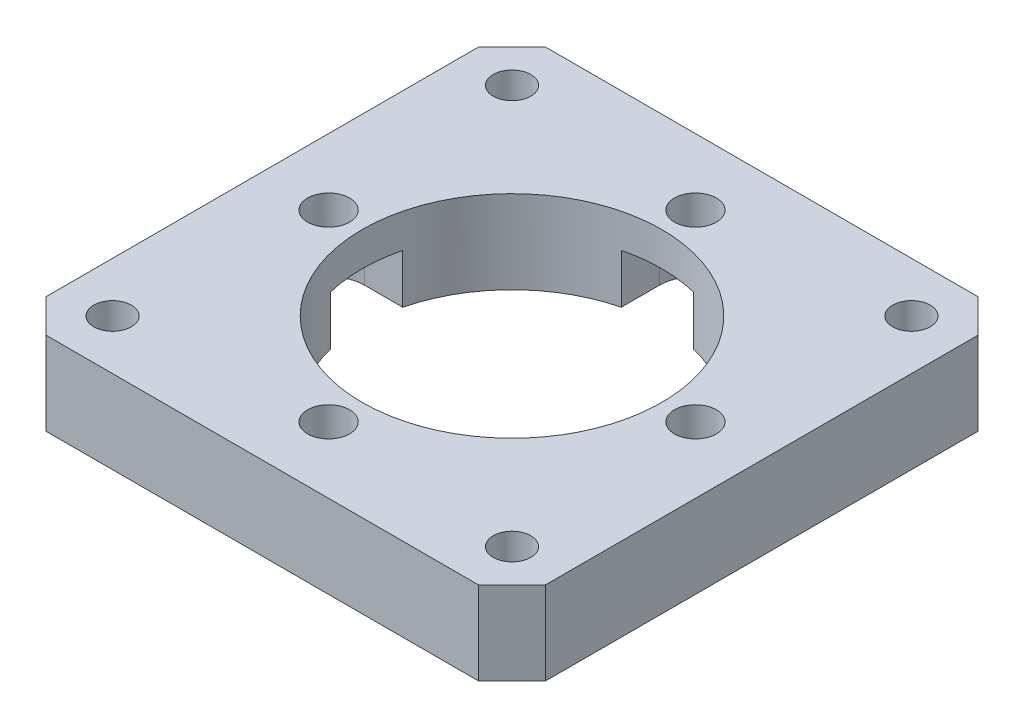
ISO-10303-21;
HEADER;
FILE_DESCRIPTION(('STEP AP214'),'2;1');
FILE_NAME('part.step','',(''),(''),'','','');
FILE_SCHEMA(('AUTOMOTIVE_DESIGN { 1 0 10303 214 1 1 1 1 }'));
ENDSEC;
DATA;
#1=APPLICATION_CONTEXT('core data for automotive mechanical design processes');
#2=APPLICATION_PROTOCOL_DEFINITION('international standard','automotive_design',2000,#1);
#3=PRODUCT_CONTEXT('',#1,'mechanical');
#4=PRODUCT('Part','Part','',(#3));
#5=PRODUCT_RELATED_PRODUCT_CATEGORY('part','',(#4));
#6=PRODUCT_DEFINITION_FORMATION('','',#4);
#7=PRODUCT_DEFINITION_CONTEXT('part definition',#1,'design');
#8=PRODUCT_DEFINITION('design','',#6,#7);
#9=PRODUCT_DEFINITION_SHAPE('','',#8);
#10=(LENGTH_UNIT() NAMED_UNIT(*) SI_UNIT(.MILLI.,.METRE.));
#11=(NAMED_UNIT(*) PLANE_ANGLE_UNIT() SI_UNIT($,.RADIAN.));
#12=(NAMED_UNIT(*) SI_UNIT($,.STERADIAN.) SOLID_ANGLE_UNIT());
#13=UNCERTAINTY_MEASURE_WITH_UNIT(LENGTH_MEASURE(1.E-05),#10,'distance_accuracy_value','');
#14=(GEOMETRIC_REPRESENTATION_CONTEXT(3) GLOBAL_UNCERTAINTY_ASSIGNED_CONTEXT((#13)) GLOBAL_UNIT_ASSIGNED_CONTEXT((#10,
#11,#12)) REPRESENTATION_CONTEXT('',''));
#15=CARTESIAN_POINT('',(0.,0.,0.));
#16=DIRECTION('',(0.,0.,1.));
#17=DIRECTION('',(1.,0.,0.));
#18=AXIS2_PLACEMENT_3D('',#15,#16,#17);
#19=CARTESIAN_POINT('',(0.,0.,-13.9954));
#20=DIRECTION('',(0.,1.,0.));
#21=DIRECTION('',(0.,0.,1.));
#22=AXIS2_PLACEMENT_3D('',#19,#20,#21);
#23=CYLINDRICAL_SURFACE('',#22,1.6002);
#24=CARTESIAN_POINT('',(0.,6.35,-13.9954));
#25=DIRECTION('',(0.,1.,0.));
#26=DIRECTION('',(0.,0.,1.));
#27=AXIS2_PLACEMENT_3D('',#24,#25,#26);
#28=CIRCLE('',#27,1.6002);
#29=CARTESIAN_POINT('',(0.,6.35,-12.3952));
#30=VERTEX_POINT('',#29);
#31=EDGE_CURVE('E327',#30,#30,#28,.T.);
#32=ORIENTED_EDGE('',*,*,#31,.T.);
#33=EDGE_LOOP('',(#32));
#34=FACE_BOUND('',#33,.T.);
#35=CARTESIAN_POINT('',(0.,3.7592,-13.9954));
#36=DIRECTION('',(0.,-1.,0.));
#37=DIRECTION('',(0.,0.,-1.));
#38=AXIS2_PLACEMENT_3D('',#35,#36,#37);
#39=CIRCLE('',#38,1.6002);
#40=CARTESIAN_POINT('',(0.,3.7592,-15.5956));
#41=VERTEX_POINT('',#40);
#42=EDGE_CURVE('E267',#41,#41,#39,.F.);
#43=ORIENTED_EDGE('',*,*,#42,.F.);
#44=EDGE_LOOP('',(#43));
#45=FACE_BOUND('',#44,.T.);
#46=ADVANCED_FACE('F37',(#34,#45),#23,.F.);
#47=CARTESIAN_POINT('',(13.9954,0.,0.));
#48=DIRECTION('',(0.,1.,0.));
#49=DIRECTION('',(0.,0.,1.));
#50=AXIS2_PLACEMENT_3D('',#47,#48,#49);
#51=CYLINDRICAL_SURFACE('',#50,1.6002);
#52=CARTESIAN_POINT('',(13.9954,6.35,0.));
#53=DIRECTION('',(0.,1.,0.));
#54=DIRECTION('',(-1.,0.,0.));
#55=AXIS2_PLACEMENT_3D('',#52,#53,#54);
#56=CIRCLE('',#55,1.6002);
#57=CARTESIAN_POINT('',(12.3952,6.35,0.));
#58=VERTEX_POINT('',#57);
#59=EDGE_CURVE('E303',#58,#58,#56,.T.);
#60=ORIENTED_EDGE('',*,*,#59,.T.);
#61=EDGE_LOOP('',(#60));
#62=FACE_BOUND('',#61,.T.);
#63=CARTESIAN_POINT('',(13.9954,3.7592,0.));
#64=DIRECTION('',(0.,-1.,0.));
#65=DIRECTION('',(0.,0.,-1.));
#66=AXIS2_PLACEMENT_3D('',#63,#64,#65);
#67=CIRCLE('',#66,1.6002);
#68=CARTESIAN_POINT('',(13.9954,3.7592,-1.60019999999995));
#69=VERTEX_POINT('',#68);
#70=EDGE_CURVE('E264',#69,#69,#67,.F.);
#71=ORIENTED_EDGE('',*,*,#70,.F.);
#72=EDGE_LOOP('',(#71));
#73=FACE_BOUND('',#72,.T.);
#74=ADVANCED_FACE('F489',(#62,#73),#51,.F.);
#75=CARTESIAN_POINT('',(-13.9954,0.,-1.46594033788936E-13));
#76=DIRECTION('',(0.,1.,0.));
#77=DIRECTION('',(0.,0.,1.));
#78=AXIS2_PLACEMENT_3D('',#75,#76,#77);
#79=CYLINDRICAL_SURFACE('',#78,1.6002);
#80=CARTESIAN_POINT('',(-13.9954,6.35,-1.46594033788936E-13));
#81=DIRECTION('',(0.,1.,0.));
#82=DIRECTION('',(1.,0.,0.));
#83=AXIS2_PLACEMENT_3D('',#80,#81,#82);
#84=CIRCLE('',#83,1.6002);
#85=CARTESIAN_POINT('',(-12.3952,6.35,-1.29832828473685E-13));
#86=VERTEX_POINT('',#85);
#87=EDGE_CURVE('E316',#86,#86,#84,.T.);
#88=ORIENTED_EDGE('',*,*,#87,.T.);
#89=EDGE_LOOP('',(#88));
#90=FACE_BOUND('',#89,.T.);
#91=CARTESIAN_POINT('',(-13.9954,3.7592,-1.46594033788936E-13));
#92=DIRECTION('',(0.,-1.,0.));
#93=DIRECTION('',(0.,0.,-1.));
#94=AXIS2_PLACEMENT_3D('',#91,#92,#93);
#95=CIRCLE('',#94,1.6002);
#96=CARTESIAN_POINT('',(-13.9954,3.7592,-1.60020000000015));
#97=VERTEX_POINT('',#96);
#98=EDGE_CURVE('E262',#97,#97,#95,.F.);
#99=ORIENTED_EDGE('',*,*,#98,.F.);
#100=EDGE_LOOP('',(#99));
#101=FACE_BOUND('',#100,.T.);
#102=ADVANCED_FACE('F495',(#90,#101),#79,.F.);
#103=CARTESIAN_POINT('',(0.,0.,13.9954));
#104=DIRECTION('',(0.,1.,0.));
#105=DIRECTION('',(0.,0.,1.));
#106=AXIS2_PLACEMENT_3D('',#103,#104,#105);
#107=CYLINDRICAL_SURFACE('',#106,1.6002);
#108=CARTESIAN_POINT('',(0.,6.35,13.9954));
#109=DIRECTION('',(0.,1.,0.));
#110=DIRECTION('',(0.,0.,-1.));
#111=AXIS2_PLACEMENT_3D('',#108,#109,#110);
#112=CIRCLE('',#111,1.6002);
#113=CARTESIAN_POINT('',(0.,6.35,12.3952));
#114=VERTEX_POINT('',#113);
#115=EDGE_CURVE('E307',#114,#114,#112,.T.);
#116=ORIENTED_EDGE('',*,*,#115,.T.);
#117=EDGE_LOOP('',(#116));
#118=FACE_BOUND('',#117,.T.);
#119=CARTESIAN_POINT('',(0.,3.7592,13.9954));
#120=DIRECTION('',(0.,-1.,0.));
#121=DIRECTION('',(0.,0.,-1.));
#122=AXIS2_PLACEMENT_3D('',#119,#120,#121);
#123=CIRCLE('',#122,1.6002);
#124=CARTESIAN_POINT('',(0.,3.7592,12.3952));
#125=VERTEX_POINT('',#124);
#126=EDGE_CURVE('E294',#125,#125,#123,.F.);
#127=ORIENTED_EDGE('',*,*,#126,.F.);
#128=EDGE_LOOP('',(#127));
#129=FACE_BOUND('',#128,.T.);
#130=ADVANCED_FACE('F512',(#118,#129),#107,.F.);
#131=CARTESIAN_POINT('',(0.,6.35,0.));
#132=DIRECTION('',(0.,1.,0.));
#133=DIRECTION('',(0.,0.,1.));
#134=AXIS2_PLACEMENT_3D('',#131,#132,#133);
#135=PLANE('',#134);
#136=CARTESIAN_POINT('',(-15.2399999999998,6.35,-15.2400000000002));
#137=DIRECTION('',(0.,1.,0.));
#138=DIRECTION('',(1.,0.,0.));
#139=AXIS2_PLACEMENT_3D('',#136,#137,#138);
#140=CIRCLE('',#139,1.4351);
#141=CARTESIAN_POINT('',(-13.8048999999998,6.35,-15.2400000000001));
#142=VERTEX_POINT('',#141);
#143=EDGE_CURVE('E299',#142,#142,#140,.T.);
#144=ORIENTED_EDGE('',*,*,#143,.F.);
#145=EDGE_LOOP('',(#144));
#146=FACE_BOUND('',#145,.T.);
#147=ORIENTED_EDGE('',*,*,#87,.F.);
#148=EDGE_LOOP('',(#147));
#149=FACE_BOUND('',#148,.T.);
#150=CARTESIAN_POINT('',(-15.24,6.35,15.24));
#151=DIRECTION('',(0.,1.,0.));
#152=DIRECTION('',(0.,0.,-1.));
#153=AXIS2_PLACEMENT_3D('',#150,#151,#152);
#154=CIRCLE('',#153,1.4351);
#155=CARTESIAN_POINT('',(-15.24,6.35,13.8049));
#156=VERTEX_POINT('',#155);
#157=EDGE_CURVE('E313',#156,#156,#154,.T.);
#158=ORIENTED_EDGE('',*,*,#157,.F.);
#159=EDGE_LOOP('',(#158));
#160=FACE_BOUND('',#159,.T.);
#161=ORIENTED_EDGE('',*,*,#115,.F.);
#162=EDGE_LOOP('',(#161));
#163=FACE_BOUND('',#162,.T.);
#164=CARTESIAN_POINT('',(15.2399999999999,6.35,15.2400000000001));
#165=DIRECTION('',(0.,1.,0.));
#166=DIRECTION('',(-1.,0.,0.));
#167=AXIS2_PLACEMENT_3D('',#164,#165,#166);
#168=CIRCLE('',#167,1.4351);
#169=CARTESIAN_POINT('',(13.8048999999999,6.35,15.24));
#170=VERTEX_POINT('',#169);
#171=EDGE_CURVE('E304',#170,#170,#168,.T.);
#172=ORIENTED_EDGE('',*,*,#171,.F.);
#173=EDGE_LOOP('',(#172));
#174=FACE_BOUND('',#173,.T.);
#175=ORIENTED_EDGE('',*,*,#59,.F.);
#176=EDGE_LOOP('',(#175));
#177=FACE_BOUND('',#176,.T.);
#178=ORIENTED_EDGE('',*,*,#31,.F.);
#179=EDGE_LOOP('',(#178));
#180=FACE_BOUND('',#179,.T.);
#181=CARTESIAN_POINT('',(15.24,6.35,-15.24));
#182=DIRECTION('',(0.,1.,0.));
#183=DIRECTION('',(0.,0.,1.));
#184=AXIS2_PLACEMENT_3D('',#181,#182,#183);
#185=CIRCLE('',#184,1.4351);
#186=CARTESIAN_POINT('',(15.24,6.35,-13.8049));
#187=VERTEX_POINT('',#186);
#188=EDGE_CURVE('E326',#187,#187,#185,.T.);
#189=ORIENTED_EDGE('',*,*,#188,.F.);
#190=EDGE_LOOP('',(#189));
#191=FACE_BOUND('',#190,.T.);
#192=DIRECTION('',(0.,0.,1.));
#193=VECTOR('',#192,1.);
#194=CARTESIAN_POINT('',(-19.05,6.35,-19.05));
#195=LINE('',#194,#193);
#196=CARTESIAN_POINT('',(-19.05,6.35,-16.51));
#197=VERTEX_POINT('',#196);
#198=CARTESIAN_POINT('',(-19.05,6.35,16.51));
#199=VERTEX_POINT('',#198);
#200=EDGE_CURVE('E351',#197,#199,#195,.T.);
#201=ORIENTED_EDGE('',*,*,#200,.T.);
#202=DIRECTION('',(-0.707106781186547,0.,-0.707106781186548));
#203=VECTOR('',#202,1.);
#204=CARTESIAN_POINT('',(-17.78,6.35,17.78));
#205=LINE('',#204,#203);
#206=CARTESIAN_POINT('',(-16.51,6.35,19.05));
#207=VERTEX_POINT('',#206);
#208=EDGE_CURVE('E391',#199,#207,#205,.F.);
#209=ORIENTED_EDGE('',*,*,#208,.T.);
#210=DIRECTION('',(1.,0.,0.));
#211=VECTOR('',#210,1.);
#212=CARTESIAN_POINT('',(-19.05,6.35,19.05));
#213=LINE('',#212,#211);
#214=CARTESIAN_POINT('',(16.51,6.35,19.05));
#215=VERTEX_POINT('',#214);
#216=EDGE_CURVE('E354',#207,#215,#213,.T.);
#217=ORIENTED_EDGE('',*,*,#216,.T.);
#218=DIRECTION('',(-0.707106781186549,0.,0.707106781186546));
#219=VECTOR('',#218,1.);
#220=CARTESIAN_POINT('',(17.7799999999999,6.35,17.78));
#221=LINE('',#220,#219);
#222=CARTESIAN_POINT('',(19.05,6.35,16.51));
#223=VERTEX_POINT('',#222);
#224=EDGE_CURVE('E389',#215,#223,#221,.F.);
#225=ORIENTED_EDGE('',*,*,#224,.T.);
#226=DIRECTION('',(0.,0.,-1.));
#227=VECTOR('',#226,1.);
#228=CARTESIAN_POINT('',(19.05,6.35,-19.05));
#229=LINE('',#228,#227);
#230=CARTESIAN_POINT('',(19.05,6.35,-16.51));
#231=VERTEX_POINT('',#230);
#232=EDGE_CURVE('E344',#223,#231,#229,.T.);
#233=ORIENTED_EDGE('',*,*,#232,.T.);
#234=DIRECTION('',(0.707106781186546,0.,0.707106781186549));
#235=VECTOR('',#234,1.);
#236=CARTESIAN_POINT('',(17.78,6.35,-17.78));
#237=LINE('',#236,#235);
#238=CARTESIAN_POINT('',(16.51,6.35,-19.05));
#239=VERTEX_POINT('',#238);
#240=EDGE_CURVE('E387',#231,#239,#237,.F.);
#241=ORIENTED_EDGE('',*,*,#240,.T.);
#242=DIRECTION('',(-1.,0.,0.));
#243=VECTOR('',#242,1.);
#244=CARTESIAN_POINT('',(-19.05,6.35,-19.05));
#245=LINE('',#244,#243);
#246=CARTESIAN_POINT('',(-16.51,6.35,-19.05));
#247=VERTEX_POINT('',#246);
#248=EDGE_CURVE('E347',#239,#247,#245,.T.);
#249=ORIENTED_EDGE('',*,*,#248,.T.);
#250=DIRECTION('',(0.70710678118655,0.,-0.707106781186546));
#251=VECTOR('',#250,1.);
#252=CARTESIAN_POINT('',(-17.7799999999999,6.35,-17.78));
#253=LINE('',#252,#251);
#254=EDGE_CURVE('E385',#247,#197,#253,.F.);
#255=ORIENTED_EDGE('',*,*,#254,.T.);
#256=EDGE_LOOP('',(#201,#209,#217,#225,#233,#241,#249,#255));
#257=FACE_BOUND('',#256,.T.);
#258=CARTESIAN_POINT('',(0.,6.35,0.));
#259=DIRECTION('',(0.,1.,0.));
#260=DIRECTION('',(0.,0.,1.));
#261=AXIS2_PLACEMENT_3D('',#258,#259,#260);
#262=CIRCLE('',#261,11.43);
#263=CARTESIAN_POINT('',(0.,6.35,11.43));
#264=VERTEX_POINT('',#263);
#265=EDGE_CURVE('E336',#264,#264,#262,.T.);
#266=ORIENTED_EDGE('',*,*,#265,.F.);
#267=EDGE_LOOP('',(#266));
#268=FACE_BOUND('',#267,.T.);
#269=ADVANCED_FACE('F509',(#146,#149,#160,#163,#174,#177,#180,#191,#257,#268),#135,.T.);
#270=CARTESIAN_POINT('',(0.,0.,0.));
#271=DIRECTION('',(0.,1.,0.));
#272=DIRECTION('',(0.,0.,1.));
#273=AXIS2_PLACEMENT_3D('',#270,#271,#272);
#274=PLANE('',#273);
#275=CARTESIAN_POINT('',(-15.2399999999998,0.,-15.2400000000002));
#276=DIRECTION('',(0.,1.,0.));
#277=DIRECTION('',(1.,0.,0.));
#278=AXIS2_PLACEMENT_3D('',#275,#276,#277);
#279=CIRCLE('',#278,1.4351);
#280=CARTESIAN_POINT('',(-13.8048999999998,0.,-15.2400000000001));
#281=VERTEX_POINT('',#280);
#282=EDGE_CURVE('E319',#281,#281,#279,.T.);
#283=ORIENTED_EDGE('',*,*,#282,.T.);
#284=EDGE_LOOP('',(#283));
#285=FACE_BOUND('',#284,.T.);
#286=CARTESIAN_POINT('',(-15.24,0.,15.24));
#287=DIRECTION('',(0.,1.,0.));
#288=DIRECTION('',(0.,0.,-1.));
#289=AXIS2_PLACEMENT_3D('',#286,#287,#288);
#290=CIRCLE('',#289,1.4351);
#291=CARTESIAN_POINT('',(-15.24,0.,13.8049));
#292=VERTEX_POINT('',#291);
#293=EDGE_CURVE('E310',#292,#292,#290,.T.);
#294=ORIENTED_EDGE('',*,*,#293,.T.);
#295=EDGE_LOOP('',(#294));
#296=FACE_BOUND('',#295,.T.);
#297=CARTESIAN_POINT('',(15.2399999999999,0.,15.2400000000001));
#298=DIRECTION('',(0.,1.,0.));
#299=DIRECTION('',(-1.,0.,0.));
#300=AXIS2_PLACEMENT_3D('',#297,#298,#299);
#301=CIRCLE('',#300,1.4351);
#302=CARTESIAN_POINT('',(13.8048999999999,0.,15.24));
#303=VERTEX_POINT('',#302);
#304=EDGE_CURVE('E300',#303,#303,#301,.T.);
#305=ORIENTED_EDGE('',*,*,#304,.T.);
#306=EDGE_LOOP('',(#305));
#307=FACE_BOUND('',#306,.T.);
#308=CARTESIAN_POINT('',(15.24,0.,-15.24));
#309=DIRECTION('',(0.,1.,0.));
#310=DIRECTION('',(0.,0.,1.));
#311=AXIS2_PLACEMENT_3D('',#308,#309,#310);
#312=CIRCLE('',#311,1.4351);
#313=CARTESIAN_POINT('',(15.24,0.,-13.8049));
#314=VERTEX_POINT('',#313);
#315=EDGE_CURVE('E331',#314,#314,#312,.T.);
#316=ORIENTED_EDGE('',*,*,#315,.T.);
#317=EDGE_LOOP('',(#316));
#318=FACE_BOUND('',#317,.T.);
#319=DIRECTION('',(1.,0.,0.));
#320=VECTOR('',#319,1.);
#321=CARTESIAN_POINT('',(-19.05,0.,19.05));
#322=LINE('',#321,#320);
#323=CARTESIAN_POINT('',(-16.51,0.,19.05));
#324=VERTEX_POINT('',#323);
#325=CARTESIAN_POINT('',(16.51,0.,19.05));
#326=VERTEX_POINT('',#325);
#327=EDGE_CURVE('E348',#324,#326,#322,.T.);
#328=ORIENTED_EDGE('',*,*,#327,.F.);
#329=DIRECTION('',(0.707106781186547,0.,0.707106781186548));
#330=VECTOR('',#329,1.);
#331=CARTESIAN_POINT('',(-16.51,0.,19.05));
#332=LINE('',#331,#330);
#333=CARTESIAN_POINT('',(-19.05,0.,16.51));
#334=VERTEX_POINT('',#333);
#335=EDGE_CURVE('E378',#324,#334,#332,.F.);
#336=ORIENTED_EDGE('',*,*,#335,.T.);
#337=DIRECTION('',(0.,0.,1.));
#338=VECTOR('',#337,1.);
#339=CARTESIAN_POINT('',(-19.05,0.,-19.05));
#340=LINE('',#339,#338);
#341=CARTESIAN_POINT('',(-19.05,0.,-16.51));
#342=VERTEX_POINT('',#341);
#343=EDGE_CURVE('E363',#342,#334,#340,.T.);
#344=ORIENTED_EDGE('',*,*,#343,.F.);
#345=DIRECTION('',(-0.70710678118655,0.,0.707106781186546));
#346=VECTOR('',#345,1.);
#347=CARTESIAN_POINT('',(-19.05,0.,-16.51));
#348=LINE('',#347,#346);
#349=CARTESIAN_POINT('',(-16.51,0.,-19.05));
#350=VERTEX_POINT('',#349);
#351=EDGE_CURVE('E372',#342,#350,#348,.F.);
#352=ORIENTED_EDGE('',*,*,#351,.T.);
#353=DIRECTION('',(-1.,0.,0.));
#354=VECTOR('',#353,1.);
#355=CARTESIAN_POINT('',(-19.05,0.,-19.05));
#356=LINE('',#355,#354);
#357=CARTESIAN_POINT('',(16.51,0.,-19.05));
#358=VERTEX_POINT('',#357);
#359=EDGE_CURVE('E360',#358,#350,#356,.T.);
#360=ORIENTED_EDGE('',*,*,#359,.F.);
#361=DIRECTION('',(-0.707106781186546,0.,-0.707106781186549));
#362=VECTOR('',#361,1.);
#363=CARTESIAN_POINT('',(16.51,0.,-19.05));
#364=LINE('',#363,#362);
#365=CARTESIAN_POINT('',(19.05,0.,-16.51));
#366=VERTEX_POINT('',#365);
#367=EDGE_CURVE('E374',#358,#366,#364,.F.);
#368=ORIENTED_EDGE('',*,*,#367,.T.);
#369=DIRECTION('',(0.,0.,-1.));
#370=VECTOR('',#369,1.);
#371=CARTESIAN_POINT('',(19.05,0.,-19.05));
#372=LINE('',#371,#370);
#373=CARTESIAN_POINT('',(19.05,0.,16.51));
#374=VERTEX_POINT('',#373);
#375=EDGE_CURVE('E339',#374,#366,#372,.T.);
#376=ORIENTED_EDGE('',*,*,#375,.F.);
#377=DIRECTION('',(0.707106781186549,0.,-0.707106781186546));
#378=VECTOR('',#377,1.);
#379=CARTESIAN_POINT('',(19.05,0.,16.51));
#380=LINE('',#379,#378);
#381=EDGE_CURVE('E376',#374,#326,#380,.F.);
#382=ORIENTED_EDGE('',*,*,#381,.T.);
#383=EDGE_LOOP('',(#328,#336,#344,#352,#360,#368,#376,#382));
#384=FACE_BOUND('',#383,.T.);
#385=CARTESIAN_POINT('',(13.9954,0.,0.));
#386=DIRECTION('',(0.,-1.,0.));
#387=DIRECTION('',(-1.,0.,0.));
#388=AXIS2_PLACEMENT_3D('',#385,#386,#387);
#389=CIRCLE('',#388,2.7559);
#390=CARTESIAN_POINT('',(13.9954,0.,-2.75590000000005));
#391=VERTEX_POINT('',#390);
#392=CARTESIAN_POINT('',(13.9954,0.,2.75589999999995));
#393=VERTEX_POINT('',#392);
#394=EDGE_CURVE('E244',#391,#393,#389,.T.);
#395=ORIENTED_EDGE('',*,*,#394,.F.);
#396=DIRECTION('',(1.,0.,0.));
#397=VECTOR('',#396,1.);
#398=CARTESIAN_POINT('',(13.9954,0.,-2.75590000000005));
#399=LINE('',#398,#397);
#400=CARTESIAN_POINT('',(11.092786628706,0.,-2.75590000000004));
#401=VERTEX_POINT('',#400);
#402=EDGE_CURVE('E248',#401,#391,#399,.T.);
#403=ORIENTED_EDGE('',*,*,#402,.F.);
#404=CARTESIAN_POINT('',(0.,0.,0.));
#405=DIRECTION('',(0.,1.,0.));
#406=DIRECTION('',(0.,0.,1.));
#407=AXIS2_PLACEMENT_3D('',#404,#405,#406);
#408=CIRCLE('',#407,11.43);
#409=CARTESIAN_POINT('',(2.7559,0.,-11.0927866287061));
#410=VERTEX_POINT('',#409);
#411=EDGE_CURVE('E343',#401,#410,#408,.T.);
#412=ORIENTED_EDGE('',*,*,#411,.T.);
#413=DIRECTION('',(0.,0.,1.));
#414=VECTOR('',#413,1.);
#415=CARTESIAN_POINT('',(2.7559,0.,-13.9954));
#416=LINE('',#415,#414);
#417=CARTESIAN_POINT('',(2.7559,0.,-13.9954));
#418=VERTEX_POINT('',#417);
#419=EDGE_CURVE('E238',#418,#410,#416,.T.);
#420=ORIENTED_EDGE('',*,*,#419,.F.);
#421=CARTESIAN_POINT('',(0.,0.,-13.9954));
#422=DIRECTION('',(0.,-1.,0.));
#423=DIRECTION('',(0.,0.,1.));
#424=AXIS2_PLACEMENT_3D('',#421,#422,#423);
#425=CIRCLE('',#424,2.7559);
#426=CARTESIAN_POINT('',(-2.7559,0.,-13.9954));
#427=VERTEX_POINT('',#426);
#428=EDGE_CURVE('E224',#427,#418,#425,.T.);
#429=ORIENTED_EDGE('',*,*,#428,.F.);
#430=DIRECTION('',(0.,0.,-1.));
#431=VECTOR('',#430,1.);
#432=CARTESIAN_POINT('',(-2.7559,0.,-13.9954));
#433=LINE('',#432,#431);
#434=CARTESIAN_POINT('',(-2.7559,0.,-11.0927866287061));
#435=VERTEX_POINT('',#434);
#436=EDGE_CURVE('E230',#435,#427,#433,.T.);
#437=ORIENTED_EDGE('',*,*,#436,.F.);
#438=CARTESIAN_POINT('',(-11.0927866287061,0.,-2.75589999999988));
#439=VERTEX_POINT('',#438);
#440=EDGE_CURVE('E441',#435,#439,#408,.T.);
#441=ORIENTED_EDGE('',*,*,#440,.T.);
#442=DIRECTION('',(1.,0.,0.));
#443=VECTOR('',#442,1.);
#444=CARTESIAN_POINT('',(-13.9954,0.,-2.75589999999985));
#445=LINE('',#444,#443);
#446=CARTESIAN_POINT('',(-13.9954,0.,-2.75589999999985));
#447=VERTEX_POINT('',#446);
#448=EDGE_CURVE('E61',#447,#439,#445,.T.);
#449=ORIENTED_EDGE('',*,*,#448,.F.);
#450=CARTESIAN_POINT('',(-13.9954,0.,1.46594033788936E-13));
#451=DIRECTION('',(0.,-1.,0.));
#452=DIRECTION('',(1.,0.,0.));
#453=AXIS2_PLACEMENT_3D('',#450,#451,#452);
#454=CIRCLE('',#453,2.7559);
#455=CARTESIAN_POINT('',(-13.9954,0.,2.75590000000015));
#456=VERTEX_POINT('',#455);
#457=EDGE_CURVE('E206',#456,#447,#454,.T.);
#458=ORIENTED_EDGE('',*,*,#457,.F.);
#459=DIRECTION('',(-1.,0.,0.));
#460=VECTOR('',#459,1.);
#461=CARTESIAN_POINT('',(13.9954,0.,2.75589999999995));
#462=LINE('',#461,#460);
#463=CARTESIAN_POINT('',(-11.0927866287061,0.,2.75590000000004));
#464=VERTEX_POINT('',#463);
#465=EDGE_CURVE('E255',#464,#456,#462,.T.);
#466=ORIENTED_EDGE('',*,*,#465,.F.);
#467=CARTESIAN_POINT('',(-2.7559,0.,11.0927866287061));
#468=VERTEX_POINT('',#467);
#469=EDGE_CURVE('E330',#464,#468,#408,.T.);
#470=ORIENTED_EDGE('',*,*,#469,.T.);
#471=DIRECTION('',(0.,0.,-1.));
#472=VECTOR('',#471,1.);
#473=CARTESIAN_POINT('',(-2.7559,0.,13.9954));
#474=LINE('',#473,#472);
#475=CARTESIAN_POINT('',(-2.7559,0.,13.9954));
#476=VERTEX_POINT('',#475);
#477=EDGE_CURVE('E287',#476,#468,#474,.T.);
#478=ORIENTED_EDGE('',*,*,#477,.F.);
#479=CARTESIAN_POINT('',(0.,0.,13.9954));
#480=DIRECTION('',(0.,-1.,0.));
#481=DIRECTION('',(0.,0.,-1.));
#482=AXIS2_PLACEMENT_3D('',#479,#480,#481);
#483=CIRCLE('',#482,2.7559);
#484=CARTESIAN_POINT('',(2.7559,0.,13.9954));
#485=VERTEX_POINT('',#484);
#486=EDGE_CURVE('E284',#485,#476,#483,.T.);
#487=ORIENTED_EDGE('',*,*,#486,.F.);
#488=DIRECTION('',(0.,0.,1.));
#489=VECTOR('',#488,1.);
#490=CARTESIAN_POINT('',(2.7559,0.,13.9954));
#491=LINE('',#490,#489);
#492=CARTESIAN_POINT('',(2.7559,0.,11.0927866287061));
#493=VERTEX_POINT('',#492);
#494=EDGE_CURVE('E279',#493,#485,#491,.T.);
#495=ORIENTED_EDGE('',*,*,#494,.F.);
#496=CARTESIAN_POINT('',(11.0927866287061,0.,2.75589999999996));
#497=VERTEX_POINT('',#496);
#498=EDGE_CURVE('E340',#493,#497,#408,.T.);
#499=ORIENTED_EDGE('',*,*,#498,.T.);
#500=EDGE_CURVE('E256',#393,#497,#462,.T.);
#501=ORIENTED_EDGE('',*,*,#500,.F.);
#502=EDGE_LOOP('',(#395,#403,#412,#420,#429,#437,#441,#449,#458,#466,#470,#478,#487,#495,#499,#501));
#503=FACE_BOUND('',#502,.T.);
#504=ADVANCED_FACE('F439',(#285,#296,#307,#318,#384,#503),#274,.F.);
#505=CARTESIAN_POINT('',(19.05,6.35,-19.05));
#506=DIRECTION('',(-1.,0.,0.));
#507=DIRECTION('',(0.,0.,1.));
#508=AXIS2_PLACEMENT_3D('',#505,#506,#507);
#509=PLANE('',#508);
#510=ORIENTED_EDGE('',*,*,#232,.F.);
#511=DIRECTION('',(0.,-1.,0.));
#512=VECTOR('',#511,1.);
#513=CARTESIAN_POINT('',(19.05,6.35,16.51));
#514=LINE('',#513,#512);
#515=EDGE_CURVE('E395',#223,#374,#514,.T.);
#516=ORIENTED_EDGE('',*,*,#515,.T.);
#517=ORIENTED_EDGE('',*,*,#375,.T.);
#518=DIRECTION('',(0.,1.,0.));
#519=VECTOR('',#518,1.);
#520=CARTESIAN_POINT('',(19.05,6.35,-16.51));
#521=LINE('',#520,#519);
#522=EDGE_CURVE('E393',#366,#231,#521,.T.);
#523=ORIENTED_EDGE('',*,*,#522,.T.);
#524=EDGE_LOOP('',(#510,#516,#517,#523));
#525=FACE_BOUND('',#524,.T.);
#526=ADVANCED_FACE('F516',(#525),#509,.F.);
#527=CARTESIAN_POINT('',(-19.05,6.35,-19.05));
#528=DIRECTION('',(0.,0.,1.));
#529=DIRECTION('',(1.,0.,0.));
#530=AXIS2_PLACEMENT_3D('',#527,#528,#529);
#531=PLANE('',#530);
#532=ORIENTED_EDGE('',*,*,#248,.F.);
#533=DIRECTION('',(0.,-1.,0.));
#534=VECTOR('',#533,1.);
#535=CARTESIAN_POINT('',(16.51,6.35,-19.05));
#536=LINE('',#535,#534);
#537=EDGE_CURVE('E400',#239,#358,#536,.T.);
#538=ORIENTED_EDGE('',*,*,#537,.T.);
#539=ORIENTED_EDGE('',*,*,#359,.T.);
#540=DIRECTION('',(0.,1.,0.));
#541=VECTOR('',#540,1.);
#542=CARTESIAN_POINT('',(-16.51,6.35,-19.05));
#543=LINE('',#542,#541);
#544=EDGE_CURVE('E398',#350,#247,#543,.T.);
#545=ORIENTED_EDGE('',*,*,#544,.T.);
#546=EDGE_LOOP('',(#532,#538,#539,#545));
#547=FACE_BOUND('',#546,.T.);
#548=ADVANCED_FACE('F524',(#547),#531,.F.);
#549=CARTESIAN_POINT('',(-19.05,6.35,-19.05));
#550=DIRECTION('',(1.,0.,0.));
#551=DIRECTION('',(0.,0.,-1.));
#552=AXIS2_PLACEMENT_3D('',#549,#550,#551);
#553=PLANE('',#552);
#554=ORIENTED_EDGE('',*,*,#343,.T.);
#555=DIRECTION('',(0.,1.,0.));
#556=VECTOR('',#555,1.);
#557=CARTESIAN_POINT('',(-19.05,6.35,16.51));
#558=LINE('',#557,#556);
#559=EDGE_CURVE('E383',#334,#199,#558,.T.);
#560=ORIENTED_EDGE('',*,*,#559,.T.);
#561=ORIENTED_EDGE('',*,*,#200,.F.);
#562=DIRECTION('',(0.,-1.,0.));
#563=VECTOR('',#562,1.);
#564=CARTESIAN_POINT('',(-19.05,6.35,-16.51));
#565=LINE('',#564,#563);
#566=EDGE_CURVE('E380',#197,#342,#565,.T.);
#567=ORIENTED_EDGE('',*,*,#566,.T.);
#568=EDGE_LOOP('',(#554,#560,#561,#567));
#569=FACE_BOUND('',#568,.T.);
#570=ADVANCED_FACE('F520',(#569),#553,.F.);
#571=CARTESIAN_POINT('',(-19.05,6.35,19.05));
#572=DIRECTION('',(0.,0.,-1.));
#573=DIRECTION('',(-1.,0.,0.));
#574=AXIS2_PLACEMENT_3D('',#571,#572,#573);
#575=PLANE('',#574);
#576=ORIENTED_EDGE('',*,*,#216,.F.);
#577=DIRECTION('',(0.,-1.,0.));
#578=VECTOR('',#577,1.);
#579=CARTESIAN_POINT('',(-16.51,6.35,19.05));
#580=LINE('',#579,#578);
#581=EDGE_CURVE('E369',#207,#324,#580,.T.);
#582=ORIENTED_EDGE('',*,*,#581,.T.);
#583=ORIENTED_EDGE('',*,*,#327,.T.);
#584=DIRECTION('',(0.,1.,0.));
#585=VECTOR('',#584,1.);
#586=CARTESIAN_POINT('',(16.51,6.35,19.05));
#587=LINE('',#586,#585);
#588=EDGE_CURVE('E357',#326,#215,#587,.T.);
#589=ORIENTED_EDGE('',*,*,#588,.T.);
#590=EDGE_LOOP('',(#576,#582,#583,#589));
#591=FACE_BOUND('',#590,.T.);
#592=ADVANCED_FACE('F508',(#591),#575,.F.);
#593=CARTESIAN_POINT('',(0.,6.35,0.));
#594=DIRECTION('',(0.,-1.,0.));
#595=DIRECTION('',(0.,0.,-1.));
#596=AXIS2_PLACEMENT_3D('',#593,#594,#595);
#597=CYLINDRICAL_SURFACE('',#596,11.43);
#598=DIRECTION('',(0.,-1.,0.));
#599=VECTOR('',#598,1.);
#600=CARTESIAN_POINT('',(11.092786628706,6.35,-2.75590000000004));
#601=LINE('',#600,#599);
#602=CARTESIAN_POINT('',(11.092786628706,3.7592,-2.75590000000004));
#603=VERTEX_POINT('',#602);
#604=EDGE_CURVE('E11',#603,#401,#601,.T.);
#605=ORIENTED_EDGE('',*,*,#604,.F.);
#606=CARTESIAN_POINT('',(0.,3.7592,0.));
#607=DIRECTION('',(0.,-1.,0.));
#608=DIRECTION('',(0.,0.,-1.));
#609=AXIS2_PLACEMENT_3D('',#606,#607,#608);
#610=CIRCLE('',#609,11.43);
#611=CARTESIAN_POINT('',(11.0927866287061,3.7592,2.75589999999996));
#612=VERTEX_POINT('',#611);
#613=EDGE_CURVE('E274',#603,#612,#610,.T.);
#614=ORIENTED_EDGE('',*,*,#613,.T.);
#615=DIRECTION('',(0.,-1.,0.));
#616=VECTOR('',#615,1.);
#617=CARTESIAN_POINT('',(11.0927866287061,6.35,2.75589999999996));
#618=LINE('',#617,#616);
#619=EDGE_CURVE('E46',#497,#612,#618,.F.);
#620=ORIENTED_EDGE('',*,*,#619,.F.);
#621=ORIENTED_EDGE('',*,*,#498,.F.);
#622=DIRECTION('',(0.,-1.,0.));
#623=VECTOR('',#622,1.);
#624=CARTESIAN_POINT('',(2.7559,6.35,11.0927866287061));
#625=LINE('',#624,#623);
#626=CARTESIAN_POINT('',(2.7559,3.7592,11.0927866287061));
#627=VERTEX_POINT('',#626);
#628=EDGE_CURVE('E408',#627,#493,#625,.T.);
#629=ORIENTED_EDGE('',*,*,#628,.F.);
#630=CARTESIAN_POINT('',(0.,3.7592,0.));
#631=DIRECTION('',(0.,-1.,0.));
#632=DIRECTION('',(0.,0.,-1.));
#633=AXIS2_PLACEMENT_3D('',#630,#631,#632);
#634=CIRCLE('',#633,11.43);
#635=CARTESIAN_POINT('',(-2.7559,3.7592,11.0927866287061));
#636=VERTEX_POINT('',#635);
#637=EDGE_CURVE('E296',#627,#636,#634,.T.);
#638=ORIENTED_EDGE('',*,*,#637,.T.);
#639=DIRECTION('',(0.,-1.,0.));
#640=VECTOR('',#639,1.);
#641=CARTESIAN_POINT('',(-2.7559,6.35,11.0927866287061));
#642=LINE('',#641,#640);
#643=EDGE_CURVE('E403',#468,#636,#642,.F.);
#644=ORIENTED_EDGE('',*,*,#643,.F.);
#645=ORIENTED_EDGE('',*,*,#469,.F.);
#646=DIRECTION('',(0.,-1.,0.));
#647=VECTOR('',#646,1.);
#648=CARTESIAN_POINT('',(-11.0927866287061,6.35,2.75590000000004));
#649=LINE('',#648,#647);
#650=CARTESIAN_POINT('',(-11.0927866287061,3.7592,2.75590000000004));
#651=VERTEX_POINT('',#650);
#652=EDGE_CURVE('E413',#651,#464,#649,.T.);
#653=ORIENTED_EDGE('',*,*,#652,.F.);
#654=CARTESIAN_POINT('',(-11.0927866287061,3.7592,-2.75589999999988));
#655=VERTEX_POINT('',#654);
#656=EDGE_CURVE('E273',#651,#655,#610,.T.);
#657=ORIENTED_EDGE('',*,*,#656,.T.);
#658=DIRECTION('',(0.,-1.,0.));
#659=VECTOR('',#658,1.);
#660=CARTESIAN_POINT('',(-11.0927866287061,6.35,-2.75589999999988));
#661=LINE('',#660,#659);
#662=EDGE_CURVE('E212',#439,#655,#661,.F.);
#663=ORIENTED_EDGE('',*,*,#662,.F.);
#664=ORIENTED_EDGE('',*,*,#440,.F.);
#665=DIRECTION('',(0.,-1.,0.));
#666=VECTOR('',#665,1.);
#667=CARTESIAN_POINT('',(-2.7559,6.35,-11.0927866287061));
#668=LINE('',#667,#666);
#669=CARTESIAN_POINT('',(-2.7559,3.7592,-11.0927866287061));
#670=VERTEX_POINT('',#669);
#671=EDGE_CURVE('E417',#670,#435,#668,.T.);
#672=ORIENTED_EDGE('',*,*,#671,.F.);
#673=CARTESIAN_POINT('',(2.7559,3.7592,-11.0927866287061));
#674=VERTEX_POINT('',#673);
#675=EDGE_CURVE('E270',#670,#674,#610,.T.);
#676=ORIENTED_EDGE('',*,*,#675,.T.);
#677=DIRECTION('',(0.,-1.,0.));
#678=VECTOR('',#677,1.);
#679=CARTESIAN_POINT('',(2.7559,6.35,-11.0927866287061));
#680=LINE('',#679,#678);
#681=EDGE_CURVE('E415',#410,#674,#680,.F.);
#682=ORIENTED_EDGE('',*,*,#681,.F.);
#683=ORIENTED_EDGE('',*,*,#411,.F.);
#684=EDGE_LOOP('',(#605,#614,#620,#621,#629,#638,#644,#645,#653,#657,#663,#664,#672,#676,#682,#683));
#685=FACE_BOUND('',#684,.T.);
#686=ORIENTED_EDGE('',*,*,#265,.T.);
#687=EDGE_LOOP('',(#686));
#688=FACE_BOUND('',#687,.T.);
#689=ADVANCED_FACE('F426',(#685,#688),#597,.F.);
#690=CARTESIAN_POINT('',(15.24,0.,-15.24));
#691=DIRECTION('',(0.,1.,0.));
#692=DIRECTION('',(0.,0.,1.));
#693=AXIS2_PLACEMENT_3D('',#690,#691,#692);
#694=CYLINDRICAL_SURFACE('',#693,1.4351);
#695=ORIENTED_EDGE('',*,*,#315,.F.);
#696=EDGE_LOOP('',(#695));
#697=FACE_BOUND('',#696,.T.);
#698=ORIENTED_EDGE('',*,*,#188,.T.);
#699=EDGE_LOOP('',(#698));
#700=FACE_BOUND('',#699,.T.);
#701=ADVANCED_FACE('F501',(#697,#700),#694,.F.);
#702=CARTESIAN_POINT('',(15.2399999999999,0.,15.2400000000001));
#703=DIRECTION('',(0.,1.,0.));
#704=DIRECTION('',(0.,0.,1.));
#705=AXIS2_PLACEMENT_3D('',#702,#703,#704);
#706=CYLINDRICAL_SURFACE('',#705,1.4351);
#707=ORIENTED_EDGE('',*,*,#304,.F.);
#708=EDGE_LOOP('',(#707));
#709=FACE_BOUND('',#708,.T.);
#710=ORIENTED_EDGE('',*,*,#171,.T.);
#711=EDGE_LOOP('',(#710));
#712=FACE_BOUND('',#711,.T.);
#713=ADVANCED_FACE('F504',(#709,#712),#706,.F.);
#714=CARTESIAN_POINT('',(-15.24,0.,15.24));
#715=DIRECTION('',(0.,1.,0.));
#716=DIRECTION('',(0.,0.,1.));
#717=AXIS2_PLACEMENT_3D('',#714,#715,#716);
#718=CYLINDRICAL_SURFACE('',#717,1.4351);
#719=ORIENTED_EDGE('',*,*,#293,.F.);
#720=EDGE_LOOP('',(#719));
#721=FACE_BOUND('',#720,.T.);
#722=ORIENTED_EDGE('',*,*,#157,.T.);
#723=EDGE_LOOP('',(#722));
#724=FACE_BOUND('',#723,.T.);
#725=ADVANCED_FACE('F596',(#721,#724),#718,.F.);
#726=CARTESIAN_POINT('',(-15.2399999999998,0.,-15.2400000000002));
#727=DIRECTION('',(0.,1.,0.));
#728=DIRECTION('',(0.,0.,1.));
#729=AXIS2_PLACEMENT_3D('',#726,#727,#728);
#730=CYLINDRICAL_SURFACE('',#729,1.4351);
#731=ORIENTED_EDGE('',*,*,#282,.F.);
#732=EDGE_LOOP('',(#731));
#733=FACE_BOUND('',#732,.T.);
#734=ORIENTED_EDGE('',*,*,#143,.T.);
#735=EDGE_LOOP('',(#734));
#736=FACE_BOUND('',#735,.T.);
#737=ADVANCED_FACE('F540',(#733,#736),#730,.F.);
#738=CARTESIAN_POINT('',(-16.51,6.35,19.05));
#739=DIRECTION('',(0.707106781186548,0.,-0.707106781186547));
#740=DIRECTION('',(0.,-1.,0.));
#741=AXIS2_PLACEMENT_3D('',#738,#739,#740);
#742=PLANE('',#741);
#743=ORIENTED_EDGE('',*,*,#208,.F.);
#744=ORIENTED_EDGE('',*,*,#559,.F.);
#745=ORIENTED_EDGE('',*,*,#335,.F.);
#746=ORIENTED_EDGE('',*,*,#581,.F.);
#747=EDGE_LOOP('',(#743,#744,#745,#746));
#748=FACE_BOUND('',#747,.T.);
#749=ADVANCED_FACE('F533',(#748),#742,.F.);
#750=CARTESIAN_POINT('',(19.05,6.35,16.51));
#751=DIRECTION('',(-0.707106781186546,0.,-0.707106781186549));
#752=DIRECTION('',(0.,-1.,0.));
#753=AXIS2_PLACEMENT_3D('',#750,#751,#752);
#754=PLANE('',#753);
#755=ORIENTED_EDGE('',*,*,#224,.F.);
#756=ORIENTED_EDGE('',*,*,#588,.F.);
#757=ORIENTED_EDGE('',*,*,#381,.F.);
#758=ORIENTED_EDGE('',*,*,#515,.F.);
#759=EDGE_LOOP('',(#755,#756,#757,#758));
#760=FACE_BOUND('',#759,.T.);
#761=ADVANCED_FACE('F539',(#760),#754,.F.);
#762=CARTESIAN_POINT('',(16.51,6.35,-19.05));
#763=DIRECTION('',(-0.707106781186549,0.,0.707106781186546));
#764=DIRECTION('',(0.,-1.,0.));
#765=AXIS2_PLACEMENT_3D('',#762,#763,#764);
#766=PLANE('',#765);
#767=ORIENTED_EDGE('',*,*,#240,.F.);
#768=ORIENTED_EDGE('',*,*,#522,.F.);
#769=ORIENTED_EDGE('',*,*,#367,.F.);
#770=ORIENTED_EDGE('',*,*,#537,.F.);
#771=EDGE_LOOP('',(#767,#768,#769,#770));
#772=FACE_BOUND('',#771,.T.);
#773=ADVANCED_FACE('F546',(#772),#766,.F.);
#774=CARTESIAN_POINT('',(-19.05,6.35,-16.51));
#775=DIRECTION('',(0.707106781186546,0.,0.70710678118655));
#776=DIRECTION('',(0.,-1.,0.));
#777=AXIS2_PLACEMENT_3D('',#774,#775,#776);
#778=PLANE('',#777);
#779=ORIENTED_EDGE('',*,*,#254,.F.);
#780=ORIENTED_EDGE('',*,*,#544,.F.);
#781=ORIENTED_EDGE('',*,*,#351,.F.);
#782=ORIENTED_EDGE('',*,*,#566,.F.);
#783=EDGE_LOOP('',(#779,#780,#781,#782));
#784=FACE_BOUND('',#783,.T.);
#785=ADVANCED_FACE('F40',(#784),#778,.F.);
#786=CARTESIAN_POINT('',(0.,3.7592,13.9954));
#787=DIRECTION('',(0.,-1.,0.));
#788=DIRECTION('',(0.,0.,-1.));
#789=AXIS2_PLACEMENT_3D('',#786,#787,#788);
#790=PLANE('',#789);
#791=DIRECTION('',(0.,0.,1.));
#792=VECTOR('',#791,1.);
#793=CARTESIAN_POINT('',(2.7559,3.7592,13.9954));
#794=LINE('',#793,#792);
#795=CARTESIAN_POINT('',(2.7559,3.7592,13.9954));
#796=VERTEX_POINT('',#795);
#797=EDGE_CURVE('E281',#627,#796,#794,.T.);
#798=ORIENTED_EDGE('',*,*,#797,.T.);
#799=CARTESIAN_POINT('',(0.,3.7592,13.9954));
#800=DIRECTION('',(0.,-1.,0.));
#801=DIRECTION('',(0.,0.,-1.));
#802=AXIS2_PLACEMENT_3D('',#799,#800,#801);
#803=CIRCLE('',#802,2.7559);
#804=CARTESIAN_POINT('',(-2.7559,3.7592,13.9954));
#805=VERTEX_POINT('',#804);
#806=EDGE_CURVE('E275',#796,#805,#803,.T.);
#807=ORIENTED_EDGE('',*,*,#806,.T.);
#808=DIRECTION('',(0.,0.,-1.));
#809=VECTOR('',#808,1.);
#810=CARTESIAN_POINT('',(-2.7559,3.7592,13.9954));
#811=LINE('',#810,#809);
#812=EDGE_CURVE('E278',#805,#636,#811,.T.);
#813=ORIENTED_EDGE('',*,*,#812,.T.);
#814=ORIENTED_EDGE('',*,*,#637,.F.);
#815=EDGE_LOOP('',(#798,#807,#813,#814));
#816=FACE_BOUND('',#815,.T.);
#817=ORIENTED_EDGE('',*,*,#126,.T.);
#818=EDGE_LOOP('',(#817));
#819=FACE_BOUND('',#818,.T.);
#820=ADVANCED_FACE('F454',(#816,#819),#790,.T.);
#821=CARTESIAN_POINT('',(0.,3.7592,13.9954));
#822=DIRECTION('',(0.,-1.,0.));
#823=DIRECTION('',(0.,0.,-1.));
#824=AXIS2_PLACEMENT_3D('',#821,#822,#823);
#825=CYLINDRICAL_SURFACE('',#824,2.7559);
#826=ORIENTED_EDGE('',*,*,#486,.T.);
#827=DIRECTION('',(0.,-1.,0.));
#828=VECTOR('',#827,1.);
#829=CARTESIAN_POINT('',(-2.7559,3.7592,13.9954));
#830=LINE('',#829,#828);
#831=EDGE_CURVE('E283',#805,#476,#830,.T.);
#832=ORIENTED_EDGE('',*,*,#831,.F.);
#833=ORIENTED_EDGE('',*,*,#806,.F.);
#834=DIRECTION('',(0.,-1.,0.));
#835=VECTOR('',#834,1.);
#836=CARTESIAN_POINT('',(2.7559,3.7592,13.9954));
#837=LINE('',#836,#835);
#838=EDGE_CURVE('E291',#796,#485,#837,.T.);
#839=ORIENTED_EDGE('',*,*,#838,.T.);
#840=EDGE_LOOP('',(#826,#832,#833,#839));
#841=FACE_BOUND('',#840,.T.);
#842=ADVANCED_FACE('F462',(#841),#825,.F.);
#843=CARTESIAN_POINT('',(2.7559,3.7592,13.9954));
#844=DIRECTION('',(1.,0.,0.));
#845=DIRECTION('',(0.,0.,-1.));
#846=AXIS2_PLACEMENT_3D('',#843,#844,#845);
#847=PLANE('',#846);
#848=ORIENTED_EDGE('',*,*,#628,.T.);
#849=ORIENTED_EDGE('',*,*,#494,.T.);
#850=ORIENTED_EDGE('',*,*,#838,.F.);
#851=ORIENTED_EDGE('',*,*,#797,.F.);
#852=EDGE_LOOP('',(#848,#849,#850,#851));
#853=FACE_BOUND('',#852,.T.);
#854=ADVANCED_FACE('F458',(#853),#847,.F.);
#855=CARTESIAN_POINT('',(-2.7559,3.7592,13.9954));
#856=DIRECTION('',(-1.,0.,0.));
#857=DIRECTION('',(0.,0.,1.));
#858=AXIS2_PLACEMENT_3D('',#855,#856,#857);
#859=PLANE('',#858);
#860=ORIENTED_EDGE('',*,*,#643,.T.);
#861=ORIENTED_EDGE('',*,*,#812,.F.);
#862=ORIENTED_EDGE('',*,*,#831,.T.);
#863=ORIENTED_EDGE('',*,*,#477,.T.);
#864=EDGE_LOOP('',(#860,#861,#862,#863));
#865=FACE_BOUND('',#864,.T.);
#866=ADVANCED_FACE('F449',(#865),#859,.F.);
#867=CARTESIAN_POINT('',(13.9954,3.7592,0.));
#868=DIRECTION('',(0.,-1.,0.));
#869=DIRECTION('',(-1.,0.,0.));
#870=AXIS2_PLACEMENT_3D('',#867,#868,#869);
#871=PLANE('',#870);
#872=ORIENTED_EDGE('',*,*,#98,.T.);
#873=EDGE_LOOP('',(#872));
#874=FACE_BOUND('',#873,.T.);
#875=DIRECTION('',(-1.,0.,0.));
#876=VECTOR('',#875,1.);
#877=CARTESIAN_POINT('',(13.9954,3.7592,2.75589999999995));
#878=LINE('',#877,#876);
#879=CARTESIAN_POINT('',(-13.9954,3.7592,2.75590000000015));
#880=VERTEX_POINT('',#879);
#881=EDGE_CURVE('E218',#651,#880,#878,.T.);
#882=ORIENTED_EDGE('',*,*,#881,.T.);
#883=CARTESIAN_POINT('',(-13.9954,3.7592,1.46594033788936E-13));
#884=DIRECTION('',(0.,-1.,0.));
#885=DIRECTION('',(1.,0.,0.));
#886=AXIS2_PLACEMENT_3D('',#883,#884,#885);
#887=CIRCLE('',#886,2.7559);
#888=CARTESIAN_POINT('',(-13.9954,3.7592,-2.75589999999985));
#889=VERTEX_POINT('',#888);
#890=EDGE_CURVE('E204',#880,#889,#887,.T.);
#891=ORIENTED_EDGE('',*,*,#890,.T.);
#892=DIRECTION('',(1.,0.,0.));
#893=VECTOR('',#892,1.);
#894=CARTESIAN_POINT('',(-13.9954,3.7592,-2.75589999999985));
#895=LINE('',#894,#893);
#896=EDGE_CURVE('E208',#889,#655,#895,.T.);
#897=ORIENTED_EDGE('',*,*,#896,.T.);
#898=ORIENTED_EDGE('',*,*,#656,.F.);
#899=EDGE_LOOP('',(#882,#891,#897,#898));
#900=FACE_BOUND('',#899,.T.);
#901=ADVANCED_FACE('F216',(#874,#900),#871,.T.);
#902=CARTESIAN_POINT('',(-13.9954,3.7592,-2.75589999999985));
#903=DIRECTION('',(0.,0.,-1.));
#904=DIRECTION('',(-1.,0.,0.));
#905=AXIS2_PLACEMENT_3D('',#902,#903,#904);
#906=PLANE('',#905);
#907=ORIENTED_EDGE('',*,*,#662,.T.);
#908=ORIENTED_EDGE('',*,*,#896,.F.);
#909=DIRECTION('',(0.,-1.,0.));
#910=VECTOR('',#909,1.);
#911=CARTESIAN_POINT('',(-13.9954,3.7592,-2.75589999999985));
#912=LINE('',#911,#910);
#913=EDGE_CURVE('E199',#889,#447,#912,.T.);
#914=ORIENTED_EDGE('',*,*,#913,.T.);
#915=ORIENTED_EDGE('',*,*,#448,.T.);
#916=EDGE_LOOP('',(#907,#908,#914,#915));
#917=FACE_BOUND('',#916,.T.);
#918=ADVANCED_FACE('F211',(#917),#906,.F.);
#919=CARTESIAN_POINT('',(13.9954,3.7592,2.75589999999995));
#920=DIRECTION('',(0.,0.,1.));
#921=DIRECTION('',(1.,0.,0.));
#922=AXIS2_PLACEMENT_3D('',#919,#920,#921);
#923=PLANE('',#922);
#924=ORIENTED_EDGE('',*,*,#652,.T.);
#925=ORIENTED_EDGE('',*,*,#465,.T.);
#926=DIRECTION('',(0.,-1.,0.));
#927=VECTOR('',#926,1.);
#928=CARTESIAN_POINT('',(-13.9954,3.7592,2.75590000000015));
#929=LINE('',#928,#927);
#930=EDGE_CURVE('E207',#880,#456,#929,.T.);
#931=ORIENTED_EDGE('',*,*,#930,.F.);
#932=ORIENTED_EDGE('',*,*,#881,.F.);
#933=EDGE_LOOP('',(#924,#925,#931,#932));
#934=FACE_BOUND('',#933,.T.);
#935=ADVANCED_FACE('F435',(#934),#923,.F.);
#936=CARTESIAN_POINT('',(-13.9954,3.7592,1.46594033788936E-13));
#937=DIRECTION('',(0.,-1.,0.));
#938=DIRECTION('',(0.,0.,-1.));
#939=AXIS2_PLACEMENT_3D('',#936,#937,#938);
#940=CYLINDRICAL_SURFACE('',#939,2.7559);
#941=ORIENTED_EDGE('',*,*,#457,.T.);
#942=ORIENTED_EDGE('',*,*,#913,.F.);
#943=ORIENTED_EDGE('',*,*,#890,.F.);
#944=ORIENTED_EDGE('',*,*,#930,.T.);
#945=EDGE_LOOP('',(#941,#942,#943,#944));
#946=FACE_BOUND('',#945,.T.);
#947=ADVANCED_FACE('F201',(#946),#940,.F.);
#948=ORIENTED_EDGE('',*,*,#70,.T.);
#949=EDGE_LOOP('',(#948));
#950=FACE_BOUND('',#949,.T.);
#951=DIRECTION('',(1.,0.,0.));
#952=VECTOR('',#951,1.);
#953=CARTESIAN_POINT('',(13.9954,3.7592,-2.75590000000005));
#954=LINE('',#953,#952);
#955=CARTESIAN_POINT('',(13.9954,3.7592,-2.75590000000005));
#956=VERTEX_POINT('',#955);
#957=EDGE_CURVE('E250',#603,#956,#954,.T.);
#958=ORIENTED_EDGE('',*,*,#957,.T.);
#959=CARTESIAN_POINT('',(13.9954,3.7592,0.));
#960=DIRECTION('',(0.,-1.,0.));
#961=DIRECTION('',(-1.,0.,0.));
#962=AXIS2_PLACEMENT_3D('',#959,#960,#961);
#963=CIRCLE('',#962,2.7559);
#964=CARTESIAN_POINT('',(13.9954,3.7592,2.75589999999995));
#965=VERTEX_POINT('',#964);
#966=EDGE_CURVE('E246',#956,#965,#963,.T.);
#967=ORIENTED_EDGE('',*,*,#966,.T.);
#968=EDGE_CURVE('E53',#965,#612,#878,.T.);
#969=ORIENTED_EDGE('',*,*,#968,.T.);
#970=ORIENTED_EDGE('',*,*,#613,.F.);
#971=EDGE_LOOP('',(#958,#967,#969,#970));
#972=FACE_BOUND('',#971,.T.);
#973=ADVANCED_FACE('F470',(#950,#972),#871,.T.);
#974=ORIENTED_EDGE('',*,*,#619,.T.);
#975=ORIENTED_EDGE('',*,*,#968,.F.);
#976=DIRECTION('',(0.,-1.,0.));
#977=VECTOR('',#976,1.);
#978=CARTESIAN_POINT('',(13.9954,3.7592,2.75589999999995));
#979=LINE('',#978,#977);
#980=EDGE_CURVE('E252',#965,#393,#979,.T.);
#981=ORIENTED_EDGE('',*,*,#980,.T.);
#982=ORIENTED_EDGE('',*,*,#500,.T.);
#983=EDGE_LOOP('',(#974,#975,#981,#982));
#984=FACE_BOUND('',#983,.T.);
#985=ADVANCED_FACE('F421',(#984),#923,.F.);
#986=CARTESIAN_POINT('',(13.9954,3.7592,-2.75590000000005));
#987=DIRECTION('',(0.,0.,-1.));
#988=DIRECTION('',(-1.,0.,0.));
#989=AXIS2_PLACEMENT_3D('',#986,#987,#988);
#990=PLANE('',#989);
#991=ORIENTED_EDGE('',*,*,#604,.T.);
#992=ORIENTED_EDGE('',*,*,#402,.T.);
#993=DIRECTION('',(0.,-1.,0.));
#994=VECTOR('',#993,1.);
#995=CARTESIAN_POINT('',(13.9954,3.7592,-2.75590000000005));
#996=LINE('',#995,#994);
#997=EDGE_CURVE('E259',#956,#391,#996,.T.);
#998=ORIENTED_EDGE('',*,*,#997,.F.);
#999=ORIENTED_EDGE('',*,*,#957,.F.);
#1000=EDGE_LOOP('',(#991,#992,#998,#999));
#1001=FACE_BOUND('',#1000,.T.);
#1002=ADVANCED_FACE('F469',(#1001),#990,.F.);
#1003=CARTESIAN_POINT('',(13.9954,3.7592,0.));
#1004=DIRECTION('',(0.,-1.,0.));
#1005=DIRECTION('',(0.,0.,-1.));
#1006=AXIS2_PLACEMENT_3D('',#1003,#1004,#1005);
#1007=CYLINDRICAL_SURFACE('',#1006,2.7559);
#1008=ORIENTED_EDGE('',*,*,#394,.T.);
#1009=ORIENTED_EDGE('',*,*,#980,.F.);
#1010=ORIENTED_EDGE('',*,*,#966,.F.);
#1011=ORIENTED_EDGE('',*,*,#997,.T.);
#1012=EDGE_LOOP('',(#1008,#1009,#1010,#1011));
#1013=FACE_BOUND('',#1012,.T.);
#1014=ADVANCED_FACE('F465',(#1013),#1007,.F.);
#1015=DIRECTION('',(0.,0.,-1.));
#1016=VECTOR('',#1015,1.);
#1017=CARTESIAN_POINT('',(-2.7559,3.7592,-13.9954));
#1018=LINE('',#1017,#1016);
#1019=CARTESIAN_POINT('',(-2.7559,3.7592,-13.9954));
#1020=VERTEX_POINT('',#1019);
#1021=EDGE_CURVE('E233',#670,#1020,#1018,.T.);
#1022=ORIENTED_EDGE('',*,*,#1021,.T.);
#1023=CARTESIAN_POINT('',(0.,3.7592,-13.9954));
#1024=DIRECTION('',(0.,-1.,0.));
#1025=DIRECTION('',(0.,0.,1.));
#1026=AXIS2_PLACEMENT_3D('',#1023,#1024,#1025);
#1027=CIRCLE('',#1026,2.7559);
#1028=CARTESIAN_POINT('',(2.7559,3.7592,-13.9954));
#1029=VERTEX_POINT('',#1028);
#1030=EDGE_CURVE('E226',#1020,#1029,#1027,.T.);
#1031=ORIENTED_EDGE('',*,*,#1030,.T.);
#1032=DIRECTION('',(0.,0.,1.));
#1033=VECTOR('',#1032,1.);
#1034=CARTESIAN_POINT('',(2.7559,3.7592,-13.9954));
#1035=LINE('',#1034,#1033);
#1036=EDGE_CURVE('E229',#1029,#674,#1035,.T.);
#1037=ORIENTED_EDGE('',*,*,#1036,.T.);
#1038=ORIENTED_EDGE('',*,*,#675,.F.);
#1039=EDGE_LOOP('',(#1022,#1031,#1037,#1038));
#1040=FACE_BOUND('',#1039,.T.);
#1041=ORIENTED_EDGE('',*,*,#42,.T.);
#1042=EDGE_LOOP('',(#1041));
#1043=FACE_BOUND('',#1042,.T.);
#1044=ADVANCED_FACE('F474',(#1040,#1043),#871,.T.);
#1045=CARTESIAN_POINT('',(0.,3.7592,-13.9954));
#1046=DIRECTION('',(0.,-1.,0.));
#1047=DIRECTION('',(0.,0.,-1.));
#1048=AXIS2_PLACEMENT_3D('',#1045,#1046,#1047);
#1049=CYLINDRICAL_SURFACE('',#1048,2.7559);
#1050=ORIENTED_EDGE('',*,*,#428,.T.);
#1051=DIRECTION('',(0.,-1.,0.));
#1052=VECTOR('',#1051,1.);
#1053=CARTESIAN_POINT('',(2.7559,3.7592,-13.9954));
#1054=LINE('',#1053,#1052);
#1055=EDGE_CURVE('E235',#1029,#418,#1054,.T.);
#1056=ORIENTED_EDGE('',*,*,#1055,.F.);
#1057=ORIENTED_EDGE('',*,*,#1030,.F.);
#1058=DIRECTION('',(0.,-1.,0.));
#1059=VECTOR('',#1058,1.);
#1060=CARTESIAN_POINT('',(-2.7559,3.7592,-13.9954));
#1061=LINE('',#1060,#1059);
#1062=EDGE_CURVE('E241',#1020,#427,#1061,.T.);
#1063=ORIENTED_EDGE('',*,*,#1062,.T.);
#1064=EDGE_LOOP('',(#1050,#1056,#1057,#1063));
#1065=FACE_BOUND('',#1064,.T.);
#1066=ADVANCED_FACE('F486',(#1065),#1049,.F.);
#1067=CARTESIAN_POINT('',(-2.7559,3.7592,-13.9954));
#1068=DIRECTION('',(-1.,0.,0.));
#1069=DIRECTION('',(0.,0.,1.));
#1070=AXIS2_PLACEMENT_3D('',#1067,#1068,#1069);
#1071=PLANE('',#1070);
#1072=ORIENTED_EDGE('',*,*,#671,.T.);
#1073=ORIENTED_EDGE('',*,*,#436,.T.);
#1074=ORIENTED_EDGE('',*,*,#1062,.F.);
#1075=ORIENTED_EDGE('',*,*,#1021,.F.);
#1076=EDGE_LOOP('',(#1072,#1073,#1074,#1075));
#1077=FACE_BOUND('',#1076,.T.);
#1078=ADVANCED_FACE('F796',(#1077),#1071,.F.);
#1079=CARTESIAN_POINT('',(2.7559,3.7592,-13.9954));
#1080=DIRECTION('',(1.,0.,0.));
#1081=DIRECTION('',(0.,0.,-1.));
#1082=AXIS2_PLACEMENT_3D('',#1079,#1080,#1081);
#1083=PLANE('',#1082);
#1084=ORIENTED_EDGE('',*,*,#681,.T.);
#1085=ORIENTED_EDGE('',*,*,#1036,.F.);
#1086=ORIENTED_EDGE('',*,*,#1055,.T.);
#1087=ORIENTED_EDGE('',*,*,#419,.T.);
#1088=EDGE_LOOP('',(#1084,#1085,#1086,#1087));
#1089=FACE_BOUND('',#1088,.T.);
#1090=ADVANCED_FACE('F805',(#1089),#1083,.F.);
#1091=CLOSED_SHELL('',(#46,#74,#102,#130,#269,#504,#526,#548,#570,#592,#689,#701,#713,#725,#737,
#749,#761,#773,#785,#820,#842,#854,#866,#901,#918,#935,#947,#973,#985,#1002,#1014,#1044,#1066,
#1078,#1090));
#1092=MANIFOLD_SOLID_BREP('B2',#1091);
#1093=ADVANCED_BREP_SHAPE_REPRESENTATION('',(#18,#1092),#14);
#1094=SHAPE_DEFINITION_REPRESENTATION(#9,#1093);
ENDSEC;
END-ISO-10303-21;
